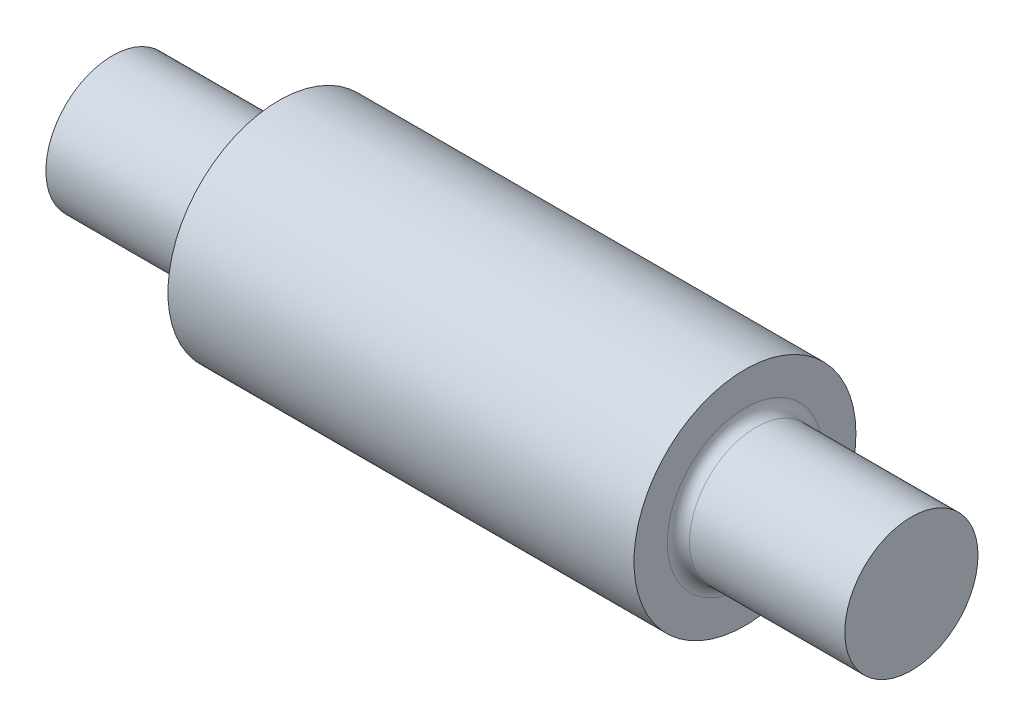
ISO-10303-21;
HEADER;
FILE_DESCRIPTION(('STEP AP214'),'2;1');
FILE_NAME('part.step','',(''),(''),'','','');
FILE_SCHEMA(('AUTOMOTIVE_DESIGN { 1 0 10303 214 1 1 1 1 }'));
ENDSEC;
DATA;
#1=APPLICATION_CONTEXT('core data for automotive mechanical design processes');
#2=APPLICATION_PROTOCOL_DEFINITION('international standard','automotive_design',2000,#1);
#3=PRODUCT_CONTEXT('',#1,'mechanical');
#4=PRODUCT('Part','Part','',(#3));
#5=PRODUCT_RELATED_PRODUCT_CATEGORY('part','',(#4));
#6=PRODUCT_DEFINITION_FORMATION('','',#4);
#7=PRODUCT_DEFINITION_CONTEXT('part definition',#1,'design');
#8=PRODUCT_DEFINITION('design','',#6,#7);
#9=PRODUCT_DEFINITION_SHAPE('','',#8);
#10=(LENGTH_UNIT() NAMED_UNIT(*) SI_UNIT(.MILLI.,.METRE.));
#11=(NAMED_UNIT(*) PLANE_ANGLE_UNIT() SI_UNIT($,.RADIAN.));
#12=(NAMED_UNIT(*) SI_UNIT($,.STERADIAN.) SOLID_ANGLE_UNIT());
#13=UNCERTAINTY_MEASURE_WITH_UNIT(LENGTH_MEASURE(1.E-05),#10,'distance_accuracy_value','');
#14=(GEOMETRIC_REPRESENTATION_CONTEXT(3) GLOBAL_UNCERTAINTY_ASSIGNED_CONTEXT((#13)) GLOBAL_UNIT_ASSIGNED_CONTEXT((#10,
#11,#12)) REPRESENTATION_CONTEXT('',''));
#15=CARTESIAN_POINT('',(0.,0.,0.));
#16=DIRECTION('',(0.,0.,1.));
#17=DIRECTION('',(1.,0.,0.));
#18=AXIS2_PLACEMENT_3D('',#15,#16,#17);
#19=CARTESIAN_POINT('',(21.,0.,0.));
#20=DIRECTION('',(-1.,0.,0.));
#21=DIRECTION('',(0.,0.,1.));
#22=AXIS2_PLACEMENT_3D('',#19,#20,#21);
#23=CYLINDRICAL_SURFACE('',#22,10.);
#24=CARTESIAN_POINT('',(21.,0.,0.));
#25=DIRECTION('',(1.,0.,0.));
#26=DIRECTION('',(0.,0.,-1.));
#27=AXIS2_PLACEMENT_3D('',#24,#25,#26);
#28=CIRCLE('',#27,10.);
#29=CARTESIAN_POINT('',(21.,0.,-10.));
#30=VERTEX_POINT('',#29);
#31=EDGE_CURVE('E51',#30,#30,#28,.T.);
#32=ORIENTED_EDGE('',*,*,#31,.F.);
#33=EDGE_LOOP('',(#32));
#34=FACE_BOUND('',#33,.T.);
#35=CARTESIAN_POINT('',(-21.,0.,0.));
#36=DIRECTION('',(1.,0.,0.));
#37=DIRECTION('',(0.,0.,-1.));
#38=AXIS2_PLACEMENT_3D('',#35,#36,#37);
#39=CIRCLE('',#38,10.);
#40=CARTESIAN_POINT('',(-21.,0.,-10.));
#41=VERTEX_POINT('',#40);
#42=EDGE_CURVE('E52',#41,#41,#39,.T.);
#43=ORIENTED_EDGE('',*,*,#42,.T.);
#44=EDGE_LOOP('',(#43));
#45=FACE_BOUND('',#44,.T.);
#46=ADVANCED_FACE('F31',(#34,#45),#23,.T.);
#47=CARTESIAN_POINT('',(21.,0.,0.));
#48=DIRECTION('',(1.,0.,0.));
#49=DIRECTION('',(0.,0.,-1.));
#50=AXIS2_PLACEMENT_3D('',#47,#48,#49);
#51=PLANE('',#50);
#52=CARTESIAN_POINT('',(21.,0.,0.));
#53=DIRECTION('',(1.,0.,0.));
#54=DIRECTION('',(0.,0.,-1.));
#55=AXIS2_PLACEMENT_3D('',#52,#53,#54);
#56=CIRCLE('',#55,7.);
#57=CARTESIAN_POINT('',(21.,0.,-7.));
#58=VERTEX_POINT('',#57);
#59=EDGE_CURVE('E10',#58,#58,#56,.F.);
#60=ORIENTED_EDGE('',*,*,#59,.T.);
#61=EDGE_LOOP('',(#60));
#62=FACE_BOUND('',#61,.T.);
#63=ORIENTED_EDGE('',*,*,#31,.T.);
#64=EDGE_LOOP('',(#63));
#65=FACE_BOUND('',#64,.T.);
#66=ADVANCED_FACE('F79',(#62,#65),#51,.T.);
#67=CARTESIAN_POINT('',(-21.,0.,0.));
#68=DIRECTION('',(1.,0.,0.));
#69=DIRECTION('',(0.,0.,-1.));
#70=AXIS2_PLACEMENT_3D('',#67,#68,#69);
#71=PLANE('',#70);
#72=CARTESIAN_POINT('',(-21.,0.,0.));
#73=DIRECTION('',(1.,0.,0.));
#74=DIRECTION('',(0.,0.,-1.));
#75=AXIS2_PLACEMENT_3D('',#72,#73,#74);
#76=CIRCLE('',#75,7.);
#77=CARTESIAN_POINT('',(-21.,0.,-7.));
#78=VERTEX_POINT('',#77);
#79=EDGE_CURVE('E46',#78,#78,#76,.T.);
#80=ORIENTED_EDGE('',*,*,#79,.T.);
#81=EDGE_LOOP('',(#80));
#82=FACE_BOUND('',#81,.T.);
#83=ORIENTED_EDGE('',*,*,#42,.F.);
#84=EDGE_LOOP('',(#83));
#85=FACE_BOUND('',#84,.T.);
#86=ADVANCED_FACE('F85',(#82,#85),#71,.F.);
#87=CARTESIAN_POINT('',(36.,0.,0.));
#88=DIRECTION('',(-1.,0.,0.));
#89=DIRECTION('',(0.,0.,1.));
#90=AXIS2_PLACEMENT_3D('',#87,#88,#89);
#91=CYLINDRICAL_SURFACE('',#90,6.);
#92=CARTESIAN_POINT('',(22.,0.,0.));
#93=DIRECTION('',(1.,0.,0.));
#94=DIRECTION('',(0.,0.,-1.));
#95=AXIS2_PLACEMENT_3D('',#92,#93,#94);
#96=CIRCLE('',#95,6.);
#97=CARTESIAN_POINT('',(22.,0.,-6.));
#98=VERTEX_POINT('',#97);
#99=EDGE_CURVE('E38',#98,#98,#96,.T.);
#100=ORIENTED_EDGE('',*,*,#99,.T.);
#101=EDGE_LOOP('',(#100));
#102=FACE_BOUND('',#101,.T.);
#103=CARTESIAN_POINT('',(36.,0.,0.));
#104=DIRECTION('',(1.,0.,0.));
#105=DIRECTION('',(0.,0.,-1.));
#106=AXIS2_PLACEMENT_3D('',#103,#104,#105);
#107=CIRCLE('',#106,6.);
#108=CARTESIAN_POINT('',(36.,0.,-6.));
#109=VERTEX_POINT('',#108);
#110=EDGE_CURVE('E55',#109,#109,#107,.T.);
#111=ORIENTED_EDGE('',*,*,#110,.F.);
#112=EDGE_LOOP('',(#111));
#113=FACE_BOUND('',#112,.T.);
#114=ADVANCED_FACE('F91',(#102,#113),#91,.T.);
#115=CARTESIAN_POINT('',(36.,0.,0.));
#116=DIRECTION('',(1.,0.,0.));
#117=DIRECTION('',(0.,0.,-1.));
#118=AXIS2_PLACEMENT_3D('',#115,#116,#117);
#119=PLANE('',#118);
#120=ORIENTED_EDGE('',*,*,#110,.T.);
#121=EDGE_LOOP('',(#120));
#122=FACE_BOUND('',#121,.T.);
#123=ADVANCED_FACE('F75',(#122),#119,.T.);
#124=CARTESIAN_POINT('',(-36.,0.,0.));
#125=DIRECTION('',(1.,0.,0.));
#126=DIRECTION('',(0.,0.,-1.));
#127=AXIS2_PLACEMENT_3D('',#124,#125,#126);
#128=CYLINDRICAL_SURFACE('',#127,6.);
#129=CARTESIAN_POINT('',(-22.,0.,0.));
#130=DIRECTION('',(1.,0.,0.));
#131=DIRECTION('',(0.,0.,-1.));
#132=AXIS2_PLACEMENT_3D('',#129,#130,#131);
#133=CIRCLE('',#132,6.);
#134=CARTESIAN_POINT('',(-22.,0.,-6.));
#135=VERTEX_POINT('',#134);
#136=EDGE_CURVE('E42',#135,#135,#133,.F.);
#137=ORIENTED_EDGE('',*,*,#136,.T.);
#138=EDGE_LOOP('',(#137));
#139=FACE_BOUND('',#138,.T.);
#140=CARTESIAN_POINT('',(-36.,0.,0.));
#141=DIRECTION('',(1.,0.,0.));
#142=DIRECTION('',(0.,0.,-1.));
#143=AXIS2_PLACEMENT_3D('',#140,#141,#142);
#144=CIRCLE('',#143,6.);
#145=CARTESIAN_POINT('',(-36.,0.,-6.));
#146=VERTEX_POINT('',#145);
#147=EDGE_CURVE('E60',#146,#146,#144,.T.);
#148=ORIENTED_EDGE('',*,*,#147,.T.);
#149=EDGE_LOOP('',(#148));
#150=FACE_BOUND('',#149,.T.);
#151=ADVANCED_FACE('F64',(#139,#150),#128,.T.);
#152=CARTESIAN_POINT('',(-36.,0.,0.));
#153=DIRECTION('',(-1.,0.,0.));
#154=DIRECTION('',(0.,0.,-1.));
#155=AXIS2_PLACEMENT_3D('',#152,#153,#154);
#156=PLANE('',#155);
#157=ORIENTED_EDGE('',*,*,#147,.F.);
#158=EDGE_LOOP('',(#157));
#159=FACE_BOUND('',#158,.T.);
#160=ADVANCED_FACE('F66',(#159),#156,.T.);
#161=CARTESIAN_POINT('',(-22.,0.,0.));
#162=DIRECTION('',(1.,0.,0.));
#163=DIRECTION('',(0.,0.,-1.));
#164=AXIS2_PLACEMENT_3D('',#161,#162,#163);
#165=TOROIDAL_SURFACE('',#164,7.,1.);
#166=ORIENTED_EDGE('',*,*,#136,.F.);
#167=EDGE_LOOP('',(#166));
#168=FACE_BOUND('',#167,.T.);
#169=ORIENTED_EDGE('',*,*,#79,.F.);
#170=EDGE_LOOP('',(#169));
#171=FACE_BOUND('',#170,.T.);
#172=ADVANCED_FACE('F68',(#168,#171),#165,.F.);
#173=CARTESIAN_POINT('',(22.,0.,0.));
#174=DIRECTION('',(1.,0.,0.));
#175=DIRECTION('',(0.,0.,-1.));
#176=AXIS2_PLACEMENT_3D('',#173,#174,#175);
#177=TOROIDAL_SURFACE('',#176,7.,1.);
#178=ORIENTED_EDGE('',*,*,#59,.F.);
#179=EDGE_LOOP('',(#178));
#180=FACE_BOUND('',#179,.T.);
#181=ORIENTED_EDGE('',*,*,#99,.F.);
#182=EDGE_LOOP('',(#181));
#183=FACE_BOUND('',#182,.T.);
#184=ADVANCED_FACE('F33',(#180,#183),#177,.F.);
#185=CLOSED_SHELL('',(#46,#66,#86,#114,#123,#151,#160,#172,#184));
#186=MANIFOLD_SOLID_BREP('B2',#185);
#187=ADVANCED_BREP_SHAPE_REPRESENTATION('',(#18,#186),#14);
#188=SHAPE_DEFINITION_REPRESENTATION(#9,#187);
ENDSEC;
END-ISO-10303-21;
